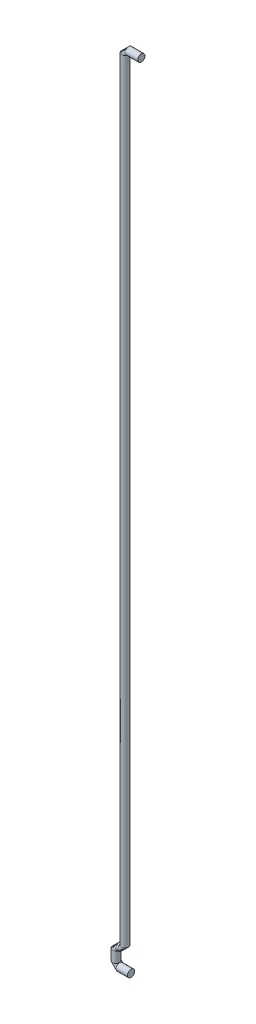
ISO-10303-21;
HEADER;
FILE_DESCRIPTION(('STEP AP214'),'2;1');
FILE_NAME('part.step','',(''),(''),'','','');
FILE_SCHEMA(('AUTOMOTIVE_DESIGN { 1 0 10303 214 1 1 1 1 }'));
ENDSEC;
DATA;
#1=APPLICATION_CONTEXT('core data for automotive mechanical design processes');
#2=APPLICATION_PROTOCOL_DEFINITION('international standard','automotive_design',2000,#1);
#3=PRODUCT_CONTEXT('',#1,'mechanical');
#4=PRODUCT('Part','Part','',(#3));
#5=PRODUCT_RELATED_PRODUCT_CATEGORY('part','',(#4));
#6=PRODUCT_DEFINITION_FORMATION('','',#4);
#7=PRODUCT_DEFINITION_CONTEXT('part definition',#1,'design');
#8=PRODUCT_DEFINITION('design','',#6,#7);
#9=PRODUCT_DEFINITION_SHAPE('','',#8);
#10=(LENGTH_UNIT() NAMED_UNIT(*) SI_UNIT(.MILLI.,.METRE.));
#11=(NAMED_UNIT(*) PLANE_ANGLE_UNIT() SI_UNIT($,.RADIAN.));
#12=(NAMED_UNIT(*) SI_UNIT($,.STERADIAN.) SOLID_ANGLE_UNIT());
#13=UNCERTAINTY_MEASURE_WITH_UNIT(LENGTH_MEASURE(1.E-05),#10,'distance_accuracy_value','');
#14=(GEOMETRIC_REPRESENTATION_CONTEXT(3) GLOBAL_UNCERTAINTY_ASSIGNED_CONTEXT((#13)) GLOBAL_UNIT_ASSIGNED_CONTEXT((#10,
#11,#12)) REPRESENTATION_CONTEXT('',''));
#15=CARTESIAN_POINT('',(0.,0.,0.));
#16=DIRECTION('',(0.,0.,1.));
#17=DIRECTION('',(1.,0.,0.));
#18=AXIS2_PLACEMENT_3D('',#15,#16,#17);
#19=CARTESIAN_POINT('',(4.5,221.1,0.));
#20=DIRECTION('',(-1.,0.,0.));
#21=DIRECTION('',(0.,0.,-1.));
#22=AXIS2_PLACEMENT_3D('',#19,#20,#21);
#23=PLANE('',#22);
#24=CARTESIAN_POINT('',(4.5,221.1,0.));
#25=DIRECTION('',(-1.,0.,0.));
#26=DIRECTION('',(0.,0.,-1.));
#27=AXIS2_PLACEMENT_3D('',#24,#25,#26);
#28=CIRCLE('',#27,1.);
#29=CARTESIAN_POINT('',(4.5,221.1,-1.));
#30=VERTEX_POINT('',#29);
#31=EDGE_CURVE('E80',#30,#30,#28,.T.);
#32=ORIENTED_EDGE('',*,*,#31,.F.);
#33=EDGE_LOOP('',(#32));
#34=FACE_BOUND('',#33,.T.);
#35=ADVANCED_FACE('F33',(#34),#23,.F.);
#36=CARTESIAN_POINT('',(1.65,0.,0.));
#37=DIRECTION('',(1.,0.,0.));
#38=DIRECTION('',(0.,0.,-1.));
#39=AXIS2_PLACEMENT_3D('',#36,#37,#38);
#40=PLANE('',#39);
#41=CARTESIAN_POINT('',(1.65,0.,0.));
#42=DIRECTION('',(1.,0.,0.));
#43=DIRECTION('',(0.,0.,-1.));
#44=AXIS2_PLACEMENT_3D('',#41,#42,#43);
#45=CIRCLE('',#44,1.);
#46=CARTESIAN_POINT('',(1.65,0.,-1.));
#47=VERTEX_POINT('',#46);
#48=EDGE_CURVE('E11',#47,#47,#45,.T.);
#49=ORIENTED_EDGE('',*,*,#48,.T.);
#50=EDGE_LOOP('',(#49));
#51=FACE_BOUND('',#50,.T.);
#52=ADVANCED_FACE('F87',(#51),#40,.T.);
#53=CARTESIAN_POINT('',(4.5,221.1,0.));
#54=DIRECTION('',(-1.,0.,0.));
#55=DIRECTION('',(0.,-1.,0.));
#56=AXIS2_PLACEMENT_3D('',#53,#54,#55);
#57=CYLINDRICAL_SURFACE('',#56,1.);
#58=CARTESIAN_POINT('',(1.,221.1,0.));
#59=DIRECTION('',(-1.,0.,0.));
#60=DIRECTION('',(0.,0.,-1.));
#61=AXIS2_PLACEMENT_3D('',#58,#59,#60);
#62=CIRCLE('',#61,1.);
#63=CARTESIAN_POINT('',(1.,220.1,0.));
#64=VERTEX_POINT('',#63);
#65=EDGE_CURVE('E45',#64,#64,#62,.T.);
#66=ORIENTED_EDGE('',*,*,#65,.F.);
#67=EDGE_LOOP('',(#66));
#68=FACE_BOUND('',#67,.T.);
#69=ORIENTED_EDGE('',*,*,#31,.T.);
#70=EDGE_LOOP('',(#69));
#71=FACE_BOUND('',#70,.T.);
#72=ADVANCED_FACE('F84',(#68,#71),#57,.T.);
#73=CARTESIAN_POINT('',(1.,220.1,0.));
#74=DIRECTION('',(0.,0.,1.));
#75=DIRECTION('',(1.,0.,0.));
#76=AXIS2_PLACEMENT_3D('',#73,#74,#75);
#77=TOROIDAL_SURFACE('',#76,1.,1.);
#78=CARTESIAN_POINT('',(0.,220.1,0.));
#79=DIRECTION('',(0.,-1.,0.));
#80=DIRECTION('',(0.,0.,-1.));
#81=AXIS2_PLACEMENT_3D('',#78,#79,#80);
#82=CIRCLE('',#81,1.);
#83=EDGE_CURVE('E76',#64,#64,#82,.T.);
#84=ORIENTED_EDGE('',*,*,#83,.F.);
#85=ORIENTED_EDGE('',*,*,#65,.T.);
#86=EDGE_LOOP('',(#84,#85));
#87=FACE_BOUND('',#86,.T.);
#88=ADVANCED_FACE('F121',(#87),#77,.T.);
#89=CARTESIAN_POINT('',(0.,220.1,0.));
#90=DIRECTION('',(0.,-1.,0.));
#91=DIRECTION('',(1.,0.,0.));
#92=AXIS2_PLACEMENT_3D('',#89,#90,#91);
#93=CYLINDRICAL_SURFACE('',#92,1.);
#94=CARTESIAN_POINT('',(0.,6.00000000000001,0.));
#95=DIRECTION('',(0.,-1.,0.));
#96=DIRECTION('',(0.,0.,-1.));
#97=AXIS2_PLACEMENT_3D('',#94,#95,#96);
#98=CIRCLE('',#97,1.);
#99=CARTESIAN_POINT('',(-1.,6.,0.));
#100=VERTEX_POINT('',#99);
#101=EDGE_CURVE('E50',#100,#100,#98,.T.);
#102=ORIENTED_EDGE('',*,*,#101,.F.);
#103=EDGE_LOOP('',(#102));
#104=FACE_BOUND('',#103,.T.);
#105=ORIENTED_EDGE('',*,*,#83,.T.);
#106=EDGE_LOOP('',(#105));
#107=FACE_BOUND('',#106,.T.);
#108=ADVANCED_FACE('F117',(#104,#107),#93,.T.);
#109=CARTESIAN_POINT('',(-1.,6.,0.));
#110=DIRECTION('',(0.,0.,-1.));
#111=DIRECTION('',(-1.,0.,0.));
#112=AXIS2_PLACEMENT_3D('',#109,#110,#111);
#113=DEGENERATE_TOROIDAL_SURFACE('',#112,1.,1.,.T.);
#114=CARTESIAN_POINT('',(-1.00000000000001,5.,0.));
#115=DIRECTION('',(-1.,0.,0.));
#116=DIRECTION('',(0.,0.,-1.));
#117=AXIS2_PLACEMENT_3D('',#114,#115,#116);
#118=CIRCLE('',#117,1.);
#119=EDGE_CURVE('E72',#100,#100,#118,.T.);
#120=ORIENTED_EDGE('',*,*,#119,.F.);
#121=ORIENTED_EDGE('',*,*,#101,.T.);
#122=EDGE_LOOP('',(#120,#121));
#123=FACE_BOUND('',#122,.T.);
#124=ADVANCED_FACE('F113',(#123),#113,.T.);
#125=CARTESIAN_POINT('',(-1.00000000000001,5.,0.));
#126=DIRECTION('',(-1.,0.,0.));
#127=DIRECTION('',(0.,-1.,0.));
#128=AXIS2_PLACEMENT_3D('',#125,#126,#127);
#129=CYLINDRICAL_SURFACE('',#128,1.);
#130=CARTESIAN_POINT('',(-1.5,5.,0.));
#131=DIRECTION('',(-1.,0.,0.));
#132=DIRECTION('',(0.,0.,-1.));
#133=AXIS2_PLACEMENT_3D('',#130,#131,#132);
#134=CIRCLE('',#133,1.);
#135=CARTESIAN_POINT('',(-1.5,4.,0.));
#136=VERTEX_POINT('',#135);
#137=EDGE_CURVE('E67',#136,#136,#134,.T.);
#138=ORIENTED_EDGE('',*,*,#137,.F.);
#139=EDGE_LOOP('',(#138));
#140=FACE_BOUND('',#139,.T.);
#141=ORIENTED_EDGE('',*,*,#119,.T.);
#142=EDGE_LOOP('',(#141));
#143=FACE_BOUND('',#142,.T.);
#144=ADVANCED_FACE('F109',(#140,#143),#129,.T.);
#145=CARTESIAN_POINT('',(-1.5,4.,0.));
#146=DIRECTION('',(0.,0.,1.));
#147=DIRECTION('',(1.,0.,0.));
#148=AXIS2_PLACEMENT_3D('',#145,#146,#147);
#149=DEGENERATE_TOROIDAL_SURFACE('',#148,1.,1.,.T.);
#150=CARTESIAN_POINT('',(-2.5,4.,0.));
#151=DIRECTION('',(0.,-1.,0.));
#152=DIRECTION('',(0.,0.,-1.));
#153=AXIS2_PLACEMENT_3D('',#150,#151,#152);
#154=CIRCLE('',#153,1.);
#155=EDGE_CURVE('E64',#136,#136,#154,.T.);
#156=ORIENTED_EDGE('',*,*,#155,.F.);
#157=ORIENTED_EDGE('',*,*,#137,.T.);
#158=EDGE_LOOP('',(#156,#157));
#159=FACE_BOUND('',#158,.T.);
#160=ADVANCED_FACE('F106',(#159),#149,.T.);
#161=CARTESIAN_POINT('',(-2.5,4.,0.));
#162=DIRECTION('',(0.,-1.,0.));
#163=DIRECTION('',(0.,0.,-1.));
#164=AXIS2_PLACEMENT_3D('',#161,#162,#163);
#165=CYLINDRICAL_SURFACE('',#164,1.);
#166=CARTESIAN_POINT('',(-2.5,1.,0.));
#167=DIRECTION('',(0.,-1.,0.));
#168=DIRECTION('',(0.,0.,-1.));
#169=AXIS2_PLACEMENT_3D('',#166,#167,#168);
#170=CIRCLE('',#169,1.);
#171=CARTESIAN_POINT('',(-1.5,1.,0.));
#172=VERTEX_POINT('',#171);
#173=EDGE_CURVE('E58',#172,#172,#170,.T.);
#174=ORIENTED_EDGE('',*,*,#173,.F.);
#175=EDGE_LOOP('',(#174));
#176=FACE_BOUND('',#175,.T.);
#177=ORIENTED_EDGE('',*,*,#155,.T.);
#178=EDGE_LOOP('',(#177));
#179=FACE_BOUND('',#178,.T.);
#180=ADVANCED_FACE('F59',(#176,#179),#165,.T.);
#181=CARTESIAN_POINT('',(-1.5,1.,0.));
#182=DIRECTION('',(0.,0.,1.));
#183=DIRECTION('',(1.,0.,0.));
#184=AXIS2_PLACEMENT_3D('',#181,#182,#183);
#185=DEGENERATE_TOROIDAL_SURFACE('',#184,1.,1.,.T.);
#186=CARTESIAN_POINT('',(-1.5,0.,0.));
#187=DIRECTION('',(1.,0.,0.));
#188=DIRECTION('',(0.,0.,-1.));
#189=AXIS2_PLACEMENT_3D('',#186,#187,#188);
#190=CIRCLE('',#189,1.);
#191=EDGE_CURVE('E40',#172,#172,#190,.T.);
#192=ORIENTED_EDGE('',*,*,#191,.F.);
#193=ORIENTED_EDGE('',*,*,#173,.T.);
#194=EDGE_LOOP('',(#192,#193));
#195=FACE_BOUND('',#194,.T.);
#196=ADVANCED_FACE('F94',(#195),#185,.T.);
#197=CARTESIAN_POINT('',(-1.5,0.,0.));
#198=DIRECTION('',(1.,0.,0.));
#199=DIRECTION('',(0.,0.,-1.));
#200=AXIS2_PLACEMENT_3D('',#197,#198,#199);
#201=CYLINDRICAL_SURFACE('',#200,1.);
#202=ORIENTED_EDGE('',*,*,#48,.F.);
#203=EDGE_LOOP('',(#202));
#204=FACE_BOUND('',#203,.T.);
#205=ORIENTED_EDGE('',*,*,#191,.T.);
#206=EDGE_LOOP('',(#205));
#207=FACE_BOUND('',#206,.T.);
#208=ADVANCED_FACE('F92',(#204,#207),#201,.T.);
#209=CLOSED_SHELL('',(#35,#52,#72,#88,#108,#124,#144,#160,#180,#196,#208));
#210=MANIFOLD_SOLID_BREP('B2',#209);
#211=ADVANCED_BREP_SHAPE_REPRESENTATION('',(#18,#210),#14);
#212=SHAPE_DEFINITION_REPRESENTATION(#9,#211);
ENDSEC;
END-ISO-10303-21;
